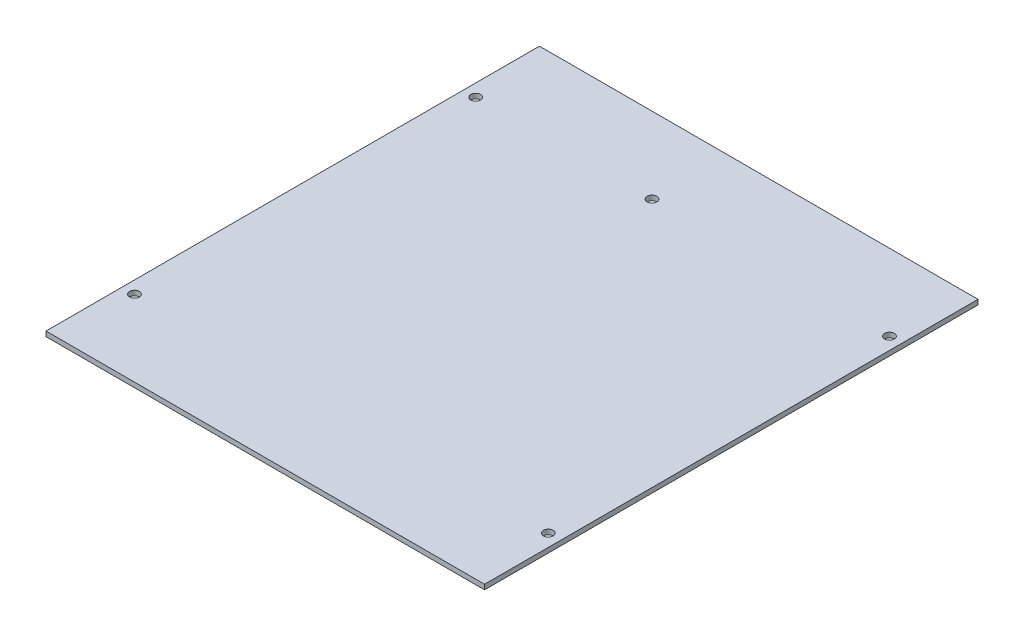
ISO-10303-21;
HEADER;
FILE_DESCRIPTION(('STEP AP214'),'2;1');
FILE_NAME('part.step','',(''),(''),'','','');
FILE_SCHEMA(('AUTOMOTIVE_DESIGN { 1 0 10303 214 1 1 1 1 }'));
ENDSEC;
DATA;
#1=APPLICATION_CONTEXT('core data for automotive mechanical design processes');
#2=APPLICATION_PROTOCOL_DEFINITION('international standard','automotive_design',2000,#1);
#3=PRODUCT_CONTEXT('',#1,'mechanical');
#4=PRODUCT('Part','Part','',(#3));
#5=PRODUCT_RELATED_PRODUCT_CATEGORY('part','',(#4));
#6=PRODUCT_DEFINITION_FORMATION('','',#4);
#7=PRODUCT_DEFINITION_CONTEXT('part definition',#1,'design');
#8=PRODUCT_DEFINITION('design','',#6,#7);
#9=PRODUCT_DEFINITION_SHAPE('','',#8);
#10=(LENGTH_UNIT() NAMED_UNIT(*) SI_UNIT(.MILLI.,.METRE.));
#11=(NAMED_UNIT(*) PLANE_ANGLE_UNIT() SI_UNIT($,.RADIAN.));
#12=(NAMED_UNIT(*) SI_UNIT($,.STERADIAN.) SOLID_ANGLE_UNIT());
#13=UNCERTAINTY_MEASURE_WITH_UNIT(LENGTH_MEASURE(1.E-05),#10,'distance_accuracy_value','');
#14=(GEOMETRIC_REPRESENTATION_CONTEXT(3) GLOBAL_UNCERTAINTY_ASSIGNED_CONTEXT((#13)) GLOBAL_UNIT_ASSIGNED_CONTEXT((#10,
#11,#12)) REPRESENTATION_CONTEXT('',''));
#15=CARTESIAN_POINT('',(0.,0.,0.));
#16=DIRECTION('',(0.,0.,1.));
#17=DIRECTION('',(1.,0.,0.));
#18=AXIS2_PLACEMENT_3D('',#15,#16,#17);
#19=CARTESIAN_POINT('',(0.,1.6,0.));
#20=DIRECTION('',(-1.,0.,0.));
#21=DIRECTION('',(0.,0.,1.));
#22=AXIS2_PLACEMENT_3D('',#19,#20,#21);
#23=PLANE('',#22);
#24=DIRECTION('',(0.,0.,-1.));
#25=VECTOR('',#24,1.);
#26=CARTESIAN_POINT('',(0.,0.,0.));
#27=LINE('',#26,#25);
#28=CARTESIAN_POINT('',(0.,0.,0.));
#29=VERTEX_POINT('',#28);
#30=CARTESIAN_POINT('',(0.,0.,-162.052));
#31=VERTEX_POINT('',#30);
#32=EDGE_CURVE('E96',#29,#31,#27,.T.);
#33=ORIENTED_EDGE('',*,*,#32,.T.);
#34=DIRECTION('',(0.,-1.,0.));
#35=VECTOR('',#34,1.);
#36=CARTESIAN_POINT('',(0.,1.6,-162.052));
#37=LINE('',#36,#35);
#38=CARTESIAN_POINT('',(0.,1.6,-162.052));
#39=VERTEX_POINT('',#38);
#40=EDGE_CURVE('E11',#39,#31,#37,.T.);
#41=ORIENTED_EDGE('',*,*,#40,.F.);
#42=DIRECTION('',(0.,0.,-1.));
#43=VECTOR('',#42,1.);
#44=CARTESIAN_POINT('',(0.,1.6,0.));
#45=LINE('',#44,#43);
#46=CARTESIAN_POINT('',(0.,1.6,0.));
#47=VERTEX_POINT('',#46);
#48=EDGE_CURVE('E82',#47,#39,#45,.T.);
#49=ORIENTED_EDGE('',*,*,#48,.F.);
#50=DIRECTION('',(0.,-1.,0.));
#51=VECTOR('',#50,1.);
#52=CARTESIAN_POINT('',(0.,1.6,0.));
#53=LINE('',#52,#51);
#54=EDGE_CURVE('E49',#47,#29,#53,.T.);
#55=ORIENTED_EDGE('',*,*,#54,.T.);
#56=EDGE_LOOP('',(#33,#41,#49,#55));
#57=FACE_BOUND('',#56,.T.);
#58=ADVANCED_FACE('F33',(#57),#23,.F.);
#59=CARTESIAN_POINT('',(0.,1.6,-162.052));
#60=DIRECTION('',(0.,0.,1.));
#61=DIRECTION('',(1.,0.,0.));
#62=AXIS2_PLACEMENT_3D('',#59,#60,#61);
#63=PLANE('',#62);
#64=DIRECTION('',(-1.,0.,0.));
#65=VECTOR('',#64,1.);
#66=CARTESIAN_POINT('',(0.,0.,-162.052));
#67=LINE('',#66,#65);
#68=CARTESIAN_POINT('',(-144.018,0.,-162.052));
#69=VERTEX_POINT('',#68);
#70=EDGE_CURVE('E87',#31,#69,#67,.T.);
#71=ORIENTED_EDGE('',*,*,#70,.T.);
#72=DIRECTION('',(0.,-1.,0.));
#73=VECTOR('',#72,1.);
#74=CARTESIAN_POINT('',(-144.018,1.6,-162.052));
#75=LINE('',#74,#73);
#76=CARTESIAN_POINT('',(-144.018,1.6,-162.052));
#77=VERTEX_POINT('',#76);
#78=EDGE_CURVE('E41',#77,#69,#75,.T.);
#79=ORIENTED_EDGE('',*,*,#78,.F.);
#80=DIRECTION('',(-1.,0.,0.));
#81=VECTOR('',#80,1.);
#82=CARTESIAN_POINT('',(0.,1.6,-162.052));
#83=LINE('',#82,#81);
#84=EDGE_CURVE('E74',#39,#77,#83,.T.);
#85=ORIENTED_EDGE('',*,*,#84,.F.);
#86=ORIENTED_EDGE('',*,*,#40,.T.);
#87=EDGE_LOOP('',(#71,#79,#85,#86));
#88=FACE_BOUND('',#87,.T.);
#89=ADVANCED_FACE('F86',(#88),#63,.F.);
#90=CARTESIAN_POINT('',(-144.018,1.6,0.));
#91=DIRECTION('',(-1.,0.,0.));
#92=DIRECTION('',(0.,0.,1.));
#93=AXIS2_PLACEMENT_3D('',#90,#91,#92);
#94=PLANE('',#93);
#95=DIRECTION('',(0.,0.,-1.));
#96=VECTOR('',#95,1.);
#97=CARTESIAN_POINT('',(-144.018,0.,0.));
#98=LINE('',#97,#96);
#99=CARTESIAN_POINT('',(-144.018,0.,0.));
#100=VERTEX_POINT('',#99);
#101=EDGE_CURVE('E100',#100,#69,#98,.T.);
#102=ORIENTED_EDGE('',*,*,#101,.F.);
#103=DIRECTION('',(0.,-1.,0.));
#104=VECTOR('',#103,1.);
#105=CARTESIAN_POINT('',(-144.018,1.6,0.));
#106=LINE('',#105,#104);
#107=CARTESIAN_POINT('',(-144.018,1.6,0.));
#108=VERTEX_POINT('',#107);
#109=EDGE_CURVE('E63',#108,#100,#106,.T.);
#110=ORIENTED_EDGE('',*,*,#109,.F.);
#111=DIRECTION('',(0.,0.,-1.));
#112=VECTOR('',#111,1.);
#113=CARTESIAN_POINT('',(-144.018,1.6,0.));
#114=LINE('',#113,#112);
#115=EDGE_CURVE('E81',#108,#77,#114,.T.);
#116=ORIENTED_EDGE('',*,*,#115,.T.);
#117=ORIENTED_EDGE('',*,*,#78,.T.);
#118=EDGE_LOOP('',(#102,#110,#116,#117));
#119=FACE_BOUND('',#118,.T.);
#120=ADVANCED_FACE('F90',(#119),#94,.T.);
#121=CARTESIAN_POINT('',(0.,1.6,0.));
#122=DIRECTION('',(0.,0.,1.));
#123=DIRECTION('',(1.,0.,0.));
#124=AXIS2_PLACEMENT_3D('',#121,#122,#123);
#125=PLANE('',#124);
#126=DIRECTION('',(-1.,0.,0.));
#127=VECTOR('',#126,1.);
#128=CARTESIAN_POINT('',(0.,0.,0.));
#129=LINE('',#128,#127);
#130=EDGE_CURVE('E102',#29,#100,#129,.T.);
#131=ORIENTED_EDGE('',*,*,#130,.F.);
#132=ORIENTED_EDGE('',*,*,#54,.F.);
#133=DIRECTION('',(-1.,0.,0.));
#134=VECTOR('',#133,1.);
#135=CARTESIAN_POINT('',(0.,1.6,0.));
#136=LINE('',#135,#134);
#137=EDGE_CURVE('E91',#47,#108,#136,.T.);
#138=ORIENTED_EDGE('',*,*,#137,.T.);
#139=ORIENTED_EDGE('',*,*,#109,.T.);
#140=EDGE_LOOP('',(#131,#132,#138,#139));
#141=FACE_BOUND('',#140,.T.);
#142=ADVANCED_FACE('F143',(#141),#125,.T.);
#143=CARTESIAN_POINT('',(0.,1.6,0.));
#144=DIRECTION('',(0.,1.,0.));
#145=DIRECTION('',(0.,0.,1.));
#146=AXIS2_PLACEMENT_3D('',#143,#144,#145);
#147=PLANE('',#146);
#148=CARTESIAN_POINT('',(-139.954,1.6,-137.033));
#149=DIRECTION('',(0.,1.,0.));
#150=DIRECTION('',(0.,0.,1.));
#151=AXIS2_PLACEMENT_3D('',#148,#149,#150);
#152=CIRCLE('',#151,1.59999999999999);
#153=CARTESIAN_POINT('',(-139.954,1.6,-135.433));
#154=VERTEX_POINT('',#153);
#155=EDGE_CURVE('E134',#154,#154,#152,.T.);
#156=ORIENTED_EDGE('',*,*,#155,.F.);
#157=EDGE_LOOP('',(#156));
#158=FACE_BOUND('',#157,.T.);
#159=CARTESIAN_POINT('',(-82.042,1.6,-137.033));
#160=DIRECTION('',(0.,1.,0.));
#161=DIRECTION('',(0.,0.,1.));
#162=AXIS2_PLACEMENT_3D('',#159,#160,#161);
#163=CIRCLE('',#162,1.6);
#164=CARTESIAN_POINT('',(-82.042,1.6,-135.433));
#165=VERTEX_POINT('',#164);
#166=EDGE_CURVE('E128',#165,#165,#163,.T.);
#167=ORIENTED_EDGE('',*,*,#166,.F.);
#168=EDGE_LOOP('',(#167));
#169=FACE_BOUND('',#168,.T.);
#170=CARTESIAN_POINT('',(-4.064,1.6,-137.033));
#171=DIRECTION('',(0.,1.,0.));
#172=DIRECTION('',(0.,0.,1.));
#173=AXIS2_PLACEMENT_3D('',#170,#171,#172);
#174=CIRCLE('',#173,1.6);
#175=CARTESIAN_POINT('',(-4.064,1.6,-135.433));
#176=VERTEX_POINT('',#175);
#177=EDGE_CURVE('E122',#176,#176,#174,.T.);
#178=ORIENTED_EDGE('',*,*,#177,.F.);
#179=EDGE_LOOP('',(#178));
#180=FACE_BOUND('',#179,.T.);
#181=CARTESIAN_POINT('',(-4.064,1.6,-25.019));
#182=DIRECTION('',(0.,1.,0.));
#183=DIRECTION('',(0.,0.,1.));
#184=AXIS2_PLACEMENT_3D('',#181,#182,#183);
#185=CIRCLE('',#184,1.6);
#186=CARTESIAN_POINT('',(-4.064,1.6,-23.419));
#187=VERTEX_POINT('',#186);
#188=EDGE_CURVE('E116',#187,#187,#185,.T.);
#189=ORIENTED_EDGE('',*,*,#188,.F.);
#190=EDGE_LOOP('',(#189));
#191=FACE_BOUND('',#190,.T.);
#192=CARTESIAN_POINT('',(-139.954,1.6,-25.019));
#193=DIRECTION('',(0.,1.,0.));
#194=DIRECTION('',(0.,0.,1.));
#195=AXIS2_PLACEMENT_3D('',#192,#193,#194);
#196=CIRCLE('',#195,1.59999999999999);
#197=CARTESIAN_POINT('',(-139.954,1.6,-23.419));
#198=VERTEX_POINT('',#197);
#199=EDGE_CURVE('E110',#198,#198,#196,.T.);
#200=ORIENTED_EDGE('',*,*,#199,.F.);
#201=EDGE_LOOP('',(#200));
#202=FACE_BOUND('',#201,.T.);
#203=ORIENTED_EDGE('',*,*,#48,.T.);
#204=ORIENTED_EDGE('',*,*,#84,.T.);
#205=ORIENTED_EDGE('',*,*,#115,.F.);
#206=ORIENTED_EDGE('',*,*,#137,.F.);
#207=EDGE_LOOP('',(#203,#204,#205,#206));
#208=FACE_BOUND('',#207,.T.);
#209=ADVANCED_FACE('F78',(#158,#169,#180,#191,#202,#208),#147,.T.);
#210=CARTESIAN_POINT('',(0.,0.,0.));
#211=DIRECTION('',(0.,1.,0.));
#212=DIRECTION('',(0.,0.,1.));
#213=AXIS2_PLACEMENT_3D('',#210,#211,#212);
#214=PLANE('',#213);
#215=CARTESIAN_POINT('',(-139.954,0.,-137.033));
#216=DIRECTION('',(0.,1.,0.));
#217=DIRECTION('',(0.,0.,1.));
#218=AXIS2_PLACEMENT_3D('',#215,#216,#217);
#219=CIRCLE('',#218,1.59999999999999);
#220=CARTESIAN_POINT('',(-139.954,0.,-135.433));
#221=VERTEX_POINT('',#220);
#222=EDGE_CURVE('E131',#221,#221,#219,.T.);
#223=ORIENTED_EDGE('',*,*,#222,.T.);
#224=EDGE_LOOP('',(#223));
#225=FACE_BOUND('',#224,.T.);
#226=CARTESIAN_POINT('',(-82.042,0.,-137.033));
#227=DIRECTION('',(0.,1.,0.));
#228=DIRECTION('',(0.,0.,1.));
#229=AXIS2_PLACEMENT_3D('',#226,#227,#228);
#230=CIRCLE('',#229,1.6);
#231=CARTESIAN_POINT('',(-82.042,0.,-135.433));
#232=VERTEX_POINT('',#231);
#233=EDGE_CURVE('E125',#232,#232,#230,.T.);
#234=ORIENTED_EDGE('',*,*,#233,.T.);
#235=EDGE_LOOP('',(#234));
#236=FACE_BOUND('',#235,.T.);
#237=CARTESIAN_POINT('',(-4.064,0.,-137.033));
#238=DIRECTION('',(0.,1.,0.));
#239=DIRECTION('',(0.,0.,1.));
#240=AXIS2_PLACEMENT_3D('',#237,#238,#239);
#241=CIRCLE('',#240,1.6);
#242=CARTESIAN_POINT('',(-4.064,0.,-135.433));
#243=VERTEX_POINT('',#242);
#244=EDGE_CURVE('E119',#243,#243,#241,.T.);
#245=ORIENTED_EDGE('',*,*,#244,.T.);
#246=EDGE_LOOP('',(#245));
#247=FACE_BOUND('',#246,.T.);
#248=CARTESIAN_POINT('',(-4.064,0.,-25.019));
#249=DIRECTION('',(0.,1.,0.));
#250=DIRECTION('',(0.,0.,1.));
#251=AXIS2_PLACEMENT_3D('',#248,#249,#250);
#252=CIRCLE('',#251,1.6);
#253=CARTESIAN_POINT('',(-4.064,0.,-23.419));
#254=VERTEX_POINT('',#253);
#255=EDGE_CURVE('E113',#254,#254,#252,.T.);
#256=ORIENTED_EDGE('',*,*,#255,.T.);
#257=EDGE_LOOP('',(#256));
#258=FACE_BOUND('',#257,.T.);
#259=CARTESIAN_POINT('',(-139.954,0.,-25.019));
#260=DIRECTION('',(0.,1.,0.));
#261=DIRECTION('',(0.,0.,1.));
#262=AXIS2_PLACEMENT_3D('',#259,#260,#261);
#263=CIRCLE('',#262,1.59999999999999);
#264=CARTESIAN_POINT('',(-139.954,0.,-23.419));
#265=VERTEX_POINT('',#264);
#266=EDGE_CURVE('E98',#265,#265,#263,.T.);
#267=ORIENTED_EDGE('',*,*,#266,.T.);
#268=EDGE_LOOP('',(#267));
#269=FACE_BOUND('',#268,.T.);
#270=ORIENTED_EDGE('',*,*,#32,.F.);
#271=ORIENTED_EDGE('',*,*,#130,.T.);
#272=ORIENTED_EDGE('',*,*,#101,.T.);
#273=ORIENTED_EDGE('',*,*,#70,.F.);
#274=EDGE_LOOP('',(#270,#271,#272,#273));
#275=FACE_BOUND('',#274,.T.);
#276=ADVANCED_FACE('F142',(#225,#236,#247,#258,#269,#275),#214,.F.);
#277=CARTESIAN_POINT('',(-139.954,1.6,-25.019));
#278=DIRECTION('',(0.,1.,0.));
#279=DIRECTION('',(0.,0.,1.));
#280=AXIS2_PLACEMENT_3D('',#277,#278,#279);
#281=CYLINDRICAL_SURFACE('',#280,1.59999999999999);
#282=ORIENTED_EDGE('',*,*,#266,.F.);
#283=EDGE_LOOP('',(#282));
#284=FACE_BOUND('',#283,.T.);
#285=ORIENTED_EDGE('',*,*,#199,.T.);
#286=EDGE_LOOP('',(#285));
#287=FACE_BOUND('',#286,.T.);
#288=ADVANCED_FACE('F153',(#284,#287),#281,.F.);
#289=CARTESIAN_POINT('',(-4.064,1.6,-25.019));
#290=DIRECTION('',(0.,1.,0.));
#291=DIRECTION('',(0.,0.,1.));
#292=AXIS2_PLACEMENT_3D('',#289,#290,#291);
#293=CYLINDRICAL_SURFACE('',#292,1.6);
#294=ORIENTED_EDGE('',*,*,#255,.F.);
#295=EDGE_LOOP('',(#294));
#296=FACE_BOUND('',#295,.T.);
#297=ORIENTED_EDGE('',*,*,#188,.T.);
#298=EDGE_LOOP('',(#297));
#299=FACE_BOUND('',#298,.T.);
#300=ADVANCED_FACE('F155',(#296,#299),#293,.F.);
#301=CARTESIAN_POINT('',(-4.064,1.6,-137.033));
#302=DIRECTION('',(0.,1.,0.));
#303=DIRECTION('',(0.,0.,1.));
#304=AXIS2_PLACEMENT_3D('',#301,#302,#303);
#305=CYLINDRICAL_SURFACE('',#304,1.6);
#306=ORIENTED_EDGE('',*,*,#244,.F.);
#307=EDGE_LOOP('',(#306));
#308=FACE_BOUND('',#307,.T.);
#309=ORIENTED_EDGE('',*,*,#177,.T.);
#310=EDGE_LOOP('',(#309));
#311=FACE_BOUND('',#310,.T.);
#312=ADVANCED_FACE('F162',(#308,#311),#305,.F.);
#313=CARTESIAN_POINT('',(-82.042,1.6,-137.033));
#314=DIRECTION('',(0.,1.,0.));
#315=DIRECTION('',(0.,0.,1.));
#316=AXIS2_PLACEMENT_3D('',#313,#314,#315);
#317=CYLINDRICAL_SURFACE('',#316,1.6);
#318=ORIENTED_EDGE('',*,*,#233,.F.);
#319=EDGE_LOOP('',(#318));
#320=FACE_BOUND('',#319,.T.);
#321=ORIENTED_EDGE('',*,*,#166,.T.);
#322=EDGE_LOOP('',(#321));
#323=FACE_BOUND('',#322,.T.);
#324=ADVANCED_FACE('F223',(#320,#323),#317,.F.);
#325=CARTESIAN_POINT('',(-139.954,1.6,-137.033));
#326=DIRECTION('',(0.,1.,0.));
#327=DIRECTION('',(0.,0.,1.));
#328=AXIS2_PLACEMENT_3D('',#325,#326,#327);
#329=CYLINDRICAL_SURFACE('',#328,1.59999999999999);
#330=ORIENTED_EDGE('',*,*,#222,.F.);
#331=EDGE_LOOP('',(#330));
#332=FACE_BOUND('',#331,.T.);
#333=ORIENTED_EDGE('',*,*,#155,.T.);
#334=EDGE_LOOP('',(#333));
#335=FACE_BOUND('',#334,.T.);
#336=ADVANCED_FACE('F138',(#332,#335),#329,.F.);
#337=CLOSED_SHELL('',(#58,#89,#120,#142,#209,#276,#288,#300,#312,#324,#336));
#338=MANIFOLD_SOLID_BREP('B2',#337);
#339=ADVANCED_BREP_SHAPE_REPRESENTATION('',(#18,#338),#14);
#340=SHAPE_DEFINITION_REPRESENTATION(#9,#339);
ENDSEC;
END-ISO-10303-21;
